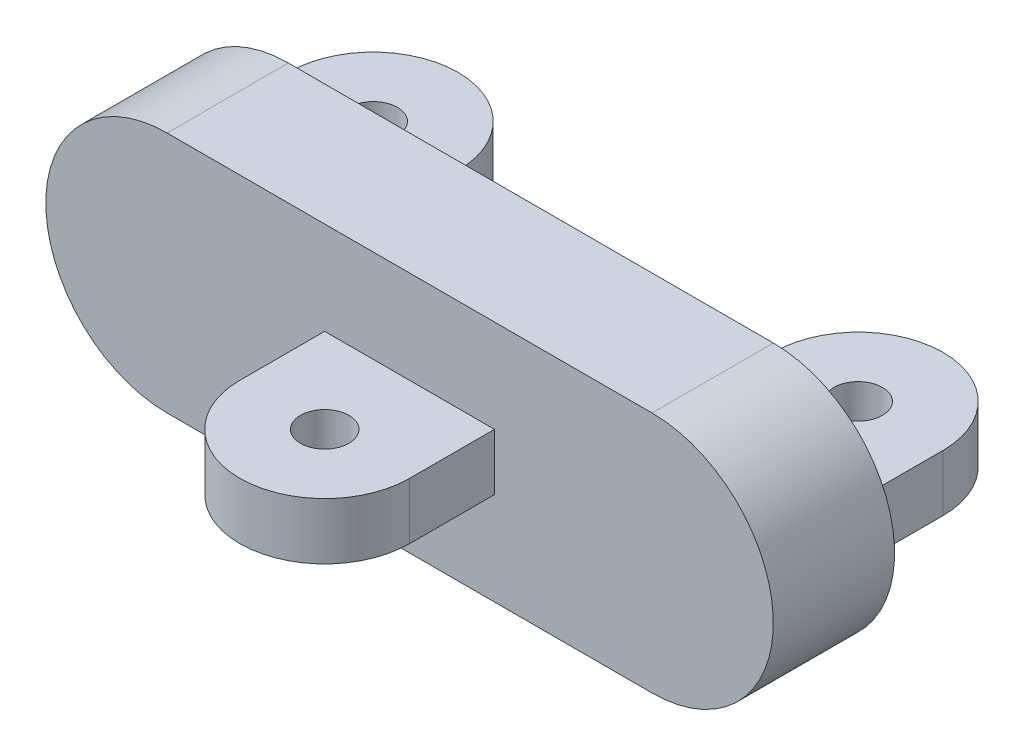
ISO-10303-21;
HEADER;
FILE_DESCRIPTION(('STEP AP214'),'2;1');
FILE_NAME('part.step','',(''),(''),'','','');
FILE_SCHEMA(('AUTOMOTIVE_DESIGN { 1 0 10303 214 1 1 1 1 }'));
ENDSEC;
DATA;
#1=APPLICATION_CONTEXT('core data for automotive mechanical design processes');
#2=APPLICATION_PROTOCOL_DEFINITION('international standard','automotive_design',2000,#1);
#3=PRODUCT_CONTEXT('',#1,'mechanical');
#4=PRODUCT('Part','Part','',(#3));
#5=PRODUCT_RELATED_PRODUCT_CATEGORY('part','',(#4));
#6=PRODUCT_DEFINITION_FORMATION('','',#4);
#7=PRODUCT_DEFINITION_CONTEXT('part definition',#1,'design');
#8=PRODUCT_DEFINITION('design','',#6,#7);
#9=PRODUCT_DEFINITION_SHAPE('','',#8);
#10=(LENGTH_UNIT() NAMED_UNIT(*) SI_UNIT(.MILLI.,.METRE.));
#11=(NAMED_UNIT(*) PLANE_ANGLE_UNIT() SI_UNIT($,.RADIAN.));
#12=(NAMED_UNIT(*) SI_UNIT($,.STERADIAN.) SOLID_ANGLE_UNIT());
#13=UNCERTAINTY_MEASURE_WITH_UNIT(LENGTH_MEASURE(1.E-05),#10,'distance_accuracy_value','');
#14=(GEOMETRIC_REPRESENTATION_CONTEXT(3) GLOBAL_UNCERTAINTY_ASSIGNED_CONTEXT((#13)) GLOBAL_UNIT_ASSIGNED_CONTEXT((#10,
#11,#12)) REPRESENTATION_CONTEXT('',''));
#15=CARTESIAN_POINT('',(0.,0.,0.));
#16=DIRECTION('',(0.,0.,1.));
#17=DIRECTION('',(1.,0.,0.));
#18=AXIS2_PLACEMENT_3D('',#15,#16,#17);
#19=CARTESIAN_POINT('',(10.,0.,-5.));
#20=DIRECTION('',(0.,0.,1.));
#21=DIRECTION('',(1.,0.,0.));
#22=AXIS2_PLACEMENT_3D('',#19,#20,#21);
#23=PLANE('',#22);
#24=DIRECTION('',(0.,1.,0.));
#25=VECTOR('',#24,1.);
#26=CARTESIAN_POINT('',(6.5,1.165,-5.));
#27=LINE('',#26,#25);
#28=CARTESIAN_POINT('',(6.5,-1.165,-5.));
#29=VERTEX_POINT('',#28);
#30=CARTESIAN_POINT('',(6.5,1.165,-5.));
#31=VERTEX_POINT('',#30);
#32=EDGE_CURVE('E225',#29,#31,#27,.T.);
#33=ORIENTED_EDGE('',*,*,#32,.F.);
#34=DIRECTION('',(-1.,0.,0.));
#35=VECTOR('',#34,1.);
#36=CARTESIAN_POINT('',(13.5,-1.165,-5.));
#37=LINE('',#36,#35);
#38=CARTESIAN_POINT('',(13.5,-1.165,-5.));
#39=VERTEX_POINT('',#38);
#40=EDGE_CURVE('E233',#39,#29,#37,.T.);
#41=ORIENTED_EDGE('',*,*,#40,.F.);
#42=DIRECTION('',(0.,-1.,0.));
#43=VECTOR('',#42,1.);
#44=CARTESIAN_POINT('',(13.5,1.165,-5.));
#45=LINE('',#44,#43);
#46=CARTESIAN_POINT('',(13.5,1.165,-5.));
#47=VERTEX_POINT('',#46);
#48=EDGE_CURVE('E245',#47,#39,#45,.T.);
#49=ORIENTED_EDGE('',*,*,#48,.F.);
#50=DIRECTION('',(1.,0.,0.));
#51=VECTOR('',#50,1.);
#52=CARTESIAN_POINT('',(13.5,1.165,-5.));
#53=LINE('',#52,#51);
#54=EDGE_CURVE('E241',#31,#47,#53,.T.);
#55=ORIENTED_EDGE('',*,*,#54,.F.);
#56=EDGE_LOOP('',(#33,#41,#49,#55));
#57=FACE_BOUND('',#56,.T.);
#58=CARTESIAN_POINT('',(10.,0.,-5.));
#59=DIRECTION('',(0.,0.,1.));
#60=DIRECTION('',(1.,0.,0.));
#61=AXIS2_PLACEMENT_3D('',#58,#59,#60);
#62=CIRCLE('',#61,5.);
#63=CARTESIAN_POINT('',(10.,-5.,-5.));
#64=VERTEX_POINT('',#63);
#65=CARTESIAN_POINT('',(9.99999999999999,5.,-5.));
#66=VERTEX_POINT('',#65);
#67=EDGE_CURVE('E320',#64,#66,#62,.T.);
#68=ORIENTED_EDGE('',*,*,#67,.F.);
#69=DIRECTION('',(1.,0.,0.));
#70=VECTOR('',#69,1.);
#71=CARTESIAN_POINT('',(-10.,-5.,-5.));
#72=LINE('',#71,#70);
#73=CARTESIAN_POINT('',(-10.,-5.,-5.));
#74=VERTEX_POINT('',#73);
#75=EDGE_CURVE('E333',#74,#64,#72,.T.);
#76=ORIENTED_EDGE('',*,*,#75,.F.);
#77=CARTESIAN_POINT('',(-10.,0.,-5.));
#78=DIRECTION('',(0.,0.,1.));
#79=DIRECTION('',(-1.,0.,0.));
#80=AXIS2_PLACEMENT_3D('',#77,#78,#79);
#81=CIRCLE('',#80,5.);
#82=CARTESIAN_POINT('',(-10.,5.,-5.));
#83=VERTEX_POINT('',#82);
#84=EDGE_CURVE('E329',#83,#74,#81,.T.);
#85=ORIENTED_EDGE('',*,*,#84,.F.);
#86=DIRECTION('',(-1.,0.,0.));
#87=VECTOR('',#86,1.);
#88=CARTESIAN_POINT('',(-10.,5.,-5.));
#89=LINE('',#88,#87);
#90=EDGE_CURVE('E324',#66,#83,#89,.T.);
#91=ORIENTED_EDGE('',*,*,#90,.F.);
#92=EDGE_LOOP('',(#68,#76,#85,#91));
#93=FACE_BOUND('',#92,.T.);
#94=DIRECTION('',(0.,1.,0.));
#95=VECTOR('',#94,1.);
#96=CARTESIAN_POINT('',(-13.5,1.165,-5.));
#97=LINE('',#96,#95);
#98=CARTESIAN_POINT('',(-13.5,-1.165,-5.));
#99=VERTEX_POINT('',#98);
#100=CARTESIAN_POINT('',(-13.5,1.165,-5.));
#101=VERTEX_POINT('',#100);
#102=EDGE_CURVE('E222',#99,#101,#97,.T.);
#103=ORIENTED_EDGE('',*,*,#102,.F.);
#104=DIRECTION('',(-1.,0.,0.));
#105=VECTOR('',#104,1.);
#106=CARTESIAN_POINT('',(-13.5,-1.165,-5.));
#107=LINE('',#106,#105);
#108=CARTESIAN_POINT('',(-6.5,-1.165,-5.));
#109=VERTEX_POINT('',#108);
#110=EDGE_CURVE('E171',#109,#99,#107,.T.);
#111=ORIENTED_EDGE('',*,*,#110,.F.);
#112=DIRECTION('',(0.,-1.,0.));
#113=VECTOR('',#112,1.);
#114=CARTESIAN_POINT('',(-6.5,1.165,-5.));
#115=LINE('',#114,#113);
#116=CARTESIAN_POINT('',(-6.5,1.165,-5.));
#117=VERTEX_POINT('',#116);
#118=EDGE_CURVE('E70',#117,#109,#115,.T.);
#119=ORIENTED_EDGE('',*,*,#118,.F.);
#120=DIRECTION('',(1.,0.,0.));
#121=VECTOR('',#120,1.);
#122=CARTESIAN_POINT('',(-13.5,1.165,-5.));
#123=LINE('',#122,#121);
#124=EDGE_CURVE('E65',#101,#117,#123,.T.);
#125=ORIENTED_EDGE('',*,*,#124,.F.);
#126=EDGE_LOOP('',(#103,#111,#119,#125));
#127=FACE_BOUND('',#126,.T.);
#128=ADVANCED_FACE('F47',(#57,#93,#127),#23,.F.);
#129=CARTESIAN_POINT('',(10.,0.,0.));
#130=DIRECTION('',(0.,0.,1.));
#131=DIRECTION('',(1.,0.,0.));
#132=AXIS2_PLACEMENT_3D('',#129,#130,#131);
#133=PLANE('',#132);
#134=CARTESIAN_POINT('',(10.,0.,0.));
#135=DIRECTION('',(0.,0.,1.));
#136=DIRECTION('',(1.,0.,0.));
#137=AXIS2_PLACEMENT_3D('',#134,#135,#136);
#138=CIRCLE('',#137,5.);
#139=CARTESIAN_POINT('',(10.,-5.,0.));
#140=VERTEX_POINT('',#139);
#141=CARTESIAN_POINT('',(9.99999999999999,5.,0.));
#142=VERTEX_POINT('',#141);
#143=EDGE_CURVE('E319',#140,#142,#138,.T.);
#144=ORIENTED_EDGE('',*,*,#143,.T.);
#145=DIRECTION('',(-1.,0.,0.));
#146=VECTOR('',#145,1.);
#147=CARTESIAN_POINT('',(-10.,5.,0.));
#148=LINE('',#147,#146);
#149=CARTESIAN_POINT('',(-10.,5.,0.));
#150=VERTEX_POINT('',#149);
#151=EDGE_CURVE('E340',#142,#150,#148,.T.);
#152=ORIENTED_EDGE('',*,*,#151,.T.);
#153=CARTESIAN_POINT('',(-10.,0.,0.));
#154=DIRECTION('',(0.,0.,1.));
#155=DIRECTION('',(-1.,0.,0.));
#156=AXIS2_PLACEMENT_3D('',#153,#154,#155);
#157=CIRCLE('',#156,5.);
#158=CARTESIAN_POINT('',(-10.,-5.,0.));
#159=VERTEX_POINT('',#158);
#160=EDGE_CURVE('E344',#150,#159,#157,.T.);
#161=ORIENTED_EDGE('',*,*,#160,.T.);
#162=DIRECTION('',(1.,0.,0.));
#163=VECTOR('',#162,1.);
#164=CARTESIAN_POINT('',(-10.,-5.,0.));
#165=LINE('',#164,#163);
#166=EDGE_CURVE('E325',#159,#140,#165,.T.);
#167=ORIENTED_EDGE('',*,*,#166,.T.);
#168=EDGE_LOOP('',(#144,#152,#161,#167));
#169=FACE_BOUND('',#168,.T.);
#170=DIRECTION('',(-1.,0.,0.));
#171=VECTOR('',#170,1.);
#172=CARTESIAN_POINT('',(-3.5,1.16666666666667,0.));
#173=LINE('',#172,#171);
#174=CARTESIAN_POINT('',(3.5,1.16666666666667,0.));
#175=VERTEX_POINT('',#174);
#176=CARTESIAN_POINT('',(-3.5,1.16666666666667,0.));
#177=VERTEX_POINT('',#176);
#178=EDGE_CURVE('E297',#175,#177,#173,.T.);
#179=ORIENTED_EDGE('',*,*,#178,.F.);
#180=DIRECTION('',(0.,1.,0.));
#181=VECTOR('',#180,1.);
#182=CARTESIAN_POINT('',(3.5,-1.16666666666667,0.));
#183=LINE('',#182,#181);
#184=CARTESIAN_POINT('',(3.5,-1.16666666666667,0.));
#185=VERTEX_POINT('',#184);
#186=EDGE_CURVE('E283',#185,#175,#183,.T.);
#187=ORIENTED_EDGE('',*,*,#186,.F.);
#188=DIRECTION('',(1.,0.,0.));
#189=VECTOR('',#188,1.);
#190=CARTESIAN_POINT('',(-3.5,-1.16666666666667,0.));
#191=LINE('',#190,#189);
#192=CARTESIAN_POINT('',(-3.5,-1.16666666666667,0.));
#193=VERTEX_POINT('',#192);
#194=EDGE_CURVE('E289',#193,#185,#191,.T.);
#195=ORIENTED_EDGE('',*,*,#194,.F.);
#196=DIRECTION('',(0.,-1.,0.));
#197=VECTOR('',#196,1.);
#198=CARTESIAN_POINT('',(-3.5,-1.16666666666667,0.));
#199=LINE('',#198,#197);
#200=EDGE_CURVE('E300',#177,#193,#199,.T.);
#201=ORIENTED_EDGE('',*,*,#200,.F.);
#202=EDGE_LOOP('',(#179,#187,#195,#201));
#203=FACE_BOUND('',#202,.T.);
#204=ADVANCED_FACE('F364',(#169,#203),#133,.T.);
#205=CARTESIAN_POINT('',(10.,0.,-5.));
#206=DIRECTION('',(0.,0.,1.));
#207=DIRECTION('',(1.,0.,0.));
#208=AXIS2_PLACEMENT_3D('',#205,#206,#207);
#209=CYLINDRICAL_SURFACE('',#208,5.);
#210=ORIENTED_EDGE('',*,*,#143,.F.);
#211=DIRECTION('',(0.,0.,1.));
#212=VECTOR('',#211,1.);
#213=CARTESIAN_POINT('',(10.,-5.,-5.));
#214=LINE('',#213,#212);
#215=EDGE_CURVE('E11',#64,#140,#214,.T.);
#216=ORIENTED_EDGE('',*,*,#215,.F.);
#217=ORIENTED_EDGE('',*,*,#67,.T.);
#218=DIRECTION('',(0.,0.,1.));
#219=VECTOR('',#218,1.);
#220=CARTESIAN_POINT('',(9.99999999999999,5.,-5.));
#221=LINE('',#220,#219);
#222=EDGE_CURVE('E51',#66,#142,#221,.T.);
#223=ORIENTED_EDGE('',*,*,#222,.T.);
#224=EDGE_LOOP('',(#210,#216,#217,#223));
#225=FACE_BOUND('',#224,.T.);
#226=ADVANCED_FACE('F49',(#225),#209,.T.);
#227=CARTESIAN_POINT('',(-10.,-5.,-5.));
#228=DIRECTION('',(0.,-1.,0.));
#229=DIRECTION('',(0.,0.,-1.));
#230=AXIS2_PLACEMENT_3D('',#227,#228,#229);
#231=PLANE('',#230);
#232=ORIENTED_EDGE('',*,*,#166,.F.);
#233=DIRECTION('',(0.,0.,1.));
#234=VECTOR('',#233,1.);
#235=CARTESIAN_POINT('',(-10.,-5.,-5.));
#236=LINE('',#235,#234);
#237=EDGE_CURVE('E57',#74,#159,#236,.T.);
#238=ORIENTED_EDGE('',*,*,#237,.F.);
#239=ORIENTED_EDGE('',*,*,#75,.T.);
#240=ORIENTED_EDGE('',*,*,#215,.T.);
#241=EDGE_LOOP('',(#232,#238,#239,#240));
#242=FACE_BOUND('',#241,.T.);
#243=ADVANCED_FACE('F368',(#242),#231,.T.);
#244=CARTESIAN_POINT('',(-10.,0.,-5.));
#245=DIRECTION('',(0.,0.,1.));
#246=DIRECTION('',(1.,0.,0.));
#247=AXIS2_PLACEMENT_3D('',#244,#245,#246);
#248=CYLINDRICAL_SURFACE('',#247,5.);
#249=ORIENTED_EDGE('',*,*,#160,.F.);
#250=DIRECTION('',(0.,0.,1.));
#251=VECTOR('',#250,1.);
#252=CARTESIAN_POINT('',(-10.,5.,-5.));
#253=LINE('',#252,#251);
#254=EDGE_CURVE('E352',#83,#150,#253,.T.);
#255=ORIENTED_EDGE('',*,*,#254,.F.);
#256=ORIENTED_EDGE('',*,*,#84,.T.);
#257=ORIENTED_EDGE('',*,*,#237,.T.);
#258=EDGE_LOOP('',(#249,#255,#256,#257));
#259=FACE_BOUND('',#258,.T.);
#260=ADVANCED_FACE('F373',(#259),#248,.T.);
#261=CARTESIAN_POINT('',(-10.,5.,-5.));
#262=DIRECTION('',(0.,1.,0.));
#263=DIRECTION('',(0.,0.,1.));
#264=AXIS2_PLACEMENT_3D('',#261,#262,#263);
#265=PLANE('',#264);
#266=ORIENTED_EDGE('',*,*,#151,.F.);
#267=ORIENTED_EDGE('',*,*,#222,.F.);
#268=ORIENTED_EDGE('',*,*,#90,.T.);
#269=ORIENTED_EDGE('',*,*,#254,.T.);
#270=EDGE_LOOP('',(#266,#267,#268,#269));
#271=FACE_BOUND('',#270,.T.);
#272=ADVANCED_FACE('F362',(#271),#265,.T.);
#273=CARTESIAN_POINT('',(3.5,-1.16666666666667,3.5));
#274=DIRECTION('',(-1.,0.,0.));
#275=DIRECTION('',(0.,0.,1.));
#276=AXIS2_PLACEMENT_3D('',#273,#274,#275);
#277=PLANE('',#276);
#278=ORIENTED_EDGE('',*,*,#186,.T.);
#279=DIRECTION('',(0.,0.,-1.));
#280=VECTOR('',#279,1.);
#281=CARTESIAN_POINT('',(3.5,1.16666666666667,3.5));
#282=LINE('',#281,#280);
#283=CARTESIAN_POINT('',(3.5,1.16666666666667,3.5));
#284=VERTEX_POINT('',#283);
#285=EDGE_CURVE('E316',#284,#175,#282,.T.);
#286=ORIENTED_EDGE('',*,*,#285,.F.);
#287=DIRECTION('',(0.,1.,0.));
#288=VECTOR('',#287,1.);
#289=CARTESIAN_POINT('',(3.5,-1.16666666666667,3.5));
#290=LINE('',#289,#288);
#291=CARTESIAN_POINT('',(3.5,-1.16666666666667,3.5));
#292=VERTEX_POINT('',#291);
#293=EDGE_CURVE('E284',#292,#284,#290,.T.);
#294=ORIENTED_EDGE('',*,*,#293,.F.);
#295=DIRECTION('',(0.,0.,-1.));
#296=VECTOR('',#295,1.);
#297=CARTESIAN_POINT('',(3.5,-1.16666666666667,3.5));
#298=LINE('',#297,#296);
#299=EDGE_CURVE('E293',#292,#185,#298,.T.);
#300=ORIENTED_EDGE('',*,*,#299,.T.);
#301=EDGE_LOOP('',(#278,#286,#294,#300));
#302=FACE_BOUND('',#301,.T.);
#303=ADVANCED_FACE('F380',(#302),#277,.F.);
#304=CARTESIAN_POINT('',(-3.5,1.16666666666667,3.5));
#305=DIRECTION('',(0.,-1.,0.));
#306=DIRECTION('',(0.,0.,-1.));
#307=AXIS2_PLACEMENT_3D('',#304,#305,#306);
#308=PLANE('',#307);
#309=CARTESIAN_POINT('',(0.,1.16666666666667,3.5));
#310=DIRECTION('',(0.,1.,0.));
#311=DIRECTION('',(0.,0.,1.));
#312=AXIS2_PLACEMENT_3D('',#309,#310,#311);
#313=CIRCLE('',#312,1.);
#314=CARTESIAN_POINT('',(0.,1.16666666666667,4.5));
#315=VERTEX_POINT('',#314);
#316=EDGE_CURVE('E267',#315,#315,#313,.T.);
#317=ORIENTED_EDGE('',*,*,#316,.F.);
#318=EDGE_LOOP('',(#317));
#319=FACE_BOUND('',#318,.T.);
#320=ORIENTED_EDGE('',*,*,#178,.T.);
#321=DIRECTION('',(0.,0.,-1.));
#322=VECTOR('',#321,1.);
#323=CARTESIAN_POINT('',(-3.5,1.16666666666667,3.5));
#324=LINE('',#323,#322);
#325=CARTESIAN_POINT('',(-3.5,1.16666666666667,3.5));
#326=VERTEX_POINT('',#325);
#327=EDGE_CURVE('E312',#326,#177,#324,.T.);
#328=ORIENTED_EDGE('',*,*,#327,.F.);
#329=CARTESIAN_POINT('',(0.,1.16666666666667,3.5));
#330=DIRECTION('',(0.,-1.,0.));
#331=DIRECTION('',(1.,0.,0.));
#332=AXIS2_PLACEMENT_3D('',#329,#330,#331);
#333=CIRCLE('',#332,3.5);
#334=EDGE_CURVE('E275',#284,#326,#333,.T.);
#335=ORIENTED_EDGE('',*,*,#334,.F.);
#336=ORIENTED_EDGE('',*,*,#285,.T.);
#337=EDGE_LOOP('',(#320,#328,#335,#336));
#338=FACE_BOUND('',#337,.T.);
#339=ADVANCED_FACE('F394',(#319,#338),#308,.F.);
#340=CARTESIAN_POINT('',(-3.5,-1.16666666666667,3.5));
#341=DIRECTION('',(1.,0.,0.));
#342=DIRECTION('',(0.,0.,-1.));
#343=AXIS2_PLACEMENT_3D('',#340,#341,#342);
#344=PLANE('',#343);
#345=ORIENTED_EDGE('',*,*,#200,.T.);
#346=DIRECTION('',(0.,0.,-1.));
#347=VECTOR('',#346,1.);
#348=CARTESIAN_POINT('',(-3.5,-1.16666666666667,3.5));
#349=LINE('',#348,#347);
#350=CARTESIAN_POINT('',(-3.5,-1.16666666666667,3.5));
#351=VERTEX_POINT('',#350);
#352=EDGE_CURVE('E309',#351,#193,#349,.T.);
#353=ORIENTED_EDGE('',*,*,#352,.F.);
#354=DIRECTION('',(0.,-1.,0.));
#355=VECTOR('',#354,1.);
#356=CARTESIAN_POINT('',(-3.5,-1.16666666666667,3.5));
#357=LINE('',#356,#355);
#358=EDGE_CURVE('E288',#326,#351,#357,.T.);
#359=ORIENTED_EDGE('',*,*,#358,.F.);
#360=ORIENTED_EDGE('',*,*,#327,.T.);
#361=EDGE_LOOP('',(#345,#353,#359,#360));
#362=FACE_BOUND('',#361,.T.);
#363=ADVANCED_FACE('F398',(#362),#344,.F.);
#364=CARTESIAN_POINT('',(-3.5,-1.16666666666667,3.5));
#365=DIRECTION('',(0.,1.,0.));
#366=DIRECTION('',(0.,0.,1.));
#367=AXIS2_PLACEMENT_3D('',#364,#365,#366);
#368=PLANE('',#367);
#369=CARTESIAN_POINT('',(0.,-1.16666666666667,3.5));
#370=DIRECTION('',(0.,1.,0.));
#371=DIRECTION('',(0.,0.,1.));
#372=AXIS2_PLACEMENT_3D('',#369,#370,#371);
#373=CIRCLE('',#372,1.);
#374=CARTESIAN_POINT('',(0.,-1.16666666666667,4.5));
#375=VERTEX_POINT('',#374);
#376=EDGE_CURVE('E271',#375,#375,#373,.F.);
#377=ORIENTED_EDGE('',*,*,#376,.F.);
#378=EDGE_LOOP('',(#377));
#379=FACE_BOUND('',#378,.T.);
#380=ORIENTED_EDGE('',*,*,#194,.T.);
#381=ORIENTED_EDGE('',*,*,#299,.F.);
#382=CARTESIAN_POINT('',(0.,-1.16666666666667,3.5));
#383=DIRECTION('',(0.,-1.,0.));
#384=DIRECTION('',(1.,0.,0.));
#385=AXIS2_PLACEMENT_3D('',#382,#383,#384);
#386=CIRCLE('',#385,3.5);
#387=EDGE_CURVE('E279',#292,#351,#386,.T.);
#388=ORIENTED_EDGE('',*,*,#387,.T.);
#389=ORIENTED_EDGE('',*,*,#352,.T.);
#390=EDGE_LOOP('',(#380,#381,#388,#389));
#391=FACE_BOUND('',#390,.T.);
#392=ADVANCED_FACE('F402',(#379,#391),#368,.F.);
#393=CARTESIAN_POINT('',(0.,1.16666666666667,3.5));
#394=DIRECTION('',(0.,-1.,0.));
#395=DIRECTION('',(1.,0.,0.));
#396=AXIS2_PLACEMENT_3D('',#393,#394,#395);
#397=CYLINDRICAL_SURFACE('',#396,3.5);
#398=ORIENTED_EDGE('',*,*,#293,.T.);
#399=ORIENTED_EDGE('',*,*,#334,.T.);
#400=ORIENTED_EDGE('',*,*,#358,.T.);
#401=ORIENTED_EDGE('',*,*,#387,.F.);
#402=EDGE_LOOP('',(#398,#399,#400,#401));
#403=FACE_BOUND('',#402,.T.);
#404=ADVANCED_FACE('F406',(#403),#397,.T.);
#405=CARTESIAN_POINT('',(0.,-5.001,3.5));
#406=DIRECTION('',(0.,1.,0.));
#407=DIRECTION('',(0.,0.,1.));
#408=AXIS2_PLACEMENT_3D('',#405,#406,#407);
#409=CYLINDRICAL_SURFACE('',#408,1.);
#410=ORIENTED_EDGE('',*,*,#316,.T.);
#411=EDGE_LOOP('',(#410));
#412=FACE_BOUND('',#411,.T.);
#413=ORIENTED_EDGE('',*,*,#376,.T.);
#414=EDGE_LOOP('',(#413));
#415=FACE_BOUND('',#414,.T.);
#416=ADVANCED_FACE('F410',(#412,#415),#409,.F.);
#417=CARTESIAN_POINT('',(6.5,1.165,-8.5));
#418=DIRECTION('',(1.,0.,0.));
#419=DIRECTION('',(0.,1.,0.));
#420=AXIS2_PLACEMENT_3D('',#417,#418,#419);
#421=PLANE('',#420);
#422=ORIENTED_EDGE('',*,*,#32,.T.);
#423=DIRECTION('',(0.,0.,1.));
#424=VECTOR('',#423,1.);
#425=CARTESIAN_POINT('',(6.5,1.165,-8.5));
#426=LINE('',#425,#424);
#427=CARTESIAN_POINT('',(6.5,1.165,-8.5));
#428=VERTEX_POINT('',#427);
#429=EDGE_CURVE('E263',#428,#31,#426,.T.);
#430=ORIENTED_EDGE('',*,*,#429,.F.);
#431=DIRECTION('',(0.,1.,0.));
#432=VECTOR('',#431,1.);
#433=CARTESIAN_POINT('',(6.5,1.165,-8.5));
#434=LINE('',#433,#432);
#435=CARTESIAN_POINT('',(6.49999999999999,-1.165,-8.49999999999998));
#436=VERTEX_POINT('',#435);
#437=EDGE_CURVE('E228',#436,#428,#434,.T.);
#438=ORIENTED_EDGE('',*,*,#437,.F.);
#439=DIRECTION('',(0.,0.,1.));
#440=VECTOR('',#439,1.);
#441=CARTESIAN_POINT('',(6.5,-1.165,-8.5));
#442=LINE('',#441,#440);
#443=EDGE_CURVE('E237',#436,#29,#442,.T.);
#444=ORIENTED_EDGE('',*,*,#443,.T.);
#445=EDGE_LOOP('',(#422,#430,#438,#444));
#446=FACE_BOUND('',#445,.T.);
#447=ADVANCED_FACE('F413',(#446),#421,.F.);
#448=CARTESIAN_POINT('',(13.5,1.165,-8.5));
#449=DIRECTION('',(0.,-1.,0.));
#450=DIRECTION('',(0.,0.,-1.));
#451=AXIS2_PLACEMENT_3D('',#448,#449,#450);
#452=PLANE('',#451);
#453=CARTESIAN_POINT('',(9.99999999999999,1.165,-8.5));
#454=DIRECTION('',(0.,1.,0.));
#455=DIRECTION('',(0.,0.,-1.));
#456=AXIS2_PLACEMENT_3D('',#453,#454,#455);
#457=CIRCLE('',#456,1.);
#458=CARTESIAN_POINT('',(9.99999999999999,1.165,-9.5));
#459=VERTEX_POINT('',#458);
#460=EDGE_CURVE('E198',#459,#459,#457,.T.);
#461=ORIENTED_EDGE('',*,*,#460,.F.);
#462=EDGE_LOOP('',(#461));
#463=FACE_BOUND('',#462,.T.);
#464=ORIENTED_EDGE('',*,*,#54,.T.);
#465=DIRECTION('',(0.,0.,1.));
#466=VECTOR('',#465,1.);
#467=CARTESIAN_POINT('',(13.5,1.165,-8.5));
#468=LINE('',#467,#466);
#469=CARTESIAN_POINT('',(13.5,1.165,-8.5));
#470=VERTEX_POINT('',#469);
#471=EDGE_CURVE('E259',#470,#47,#468,.T.);
#472=ORIENTED_EDGE('',*,*,#471,.F.);
#473=CARTESIAN_POINT('',(9.99999999999999,1.165,-8.5));
#474=DIRECTION('',(0.,-1.,0.));
#475=DIRECTION('',(0.,0.,-1.));
#476=AXIS2_PLACEMENT_3D('',#473,#474,#475);
#477=CIRCLE('',#476,3.5);
#478=EDGE_CURVE('E204',#428,#470,#477,.T.);
#479=ORIENTED_EDGE('',*,*,#478,.F.);
#480=ORIENTED_EDGE('',*,*,#429,.T.);
#481=EDGE_LOOP('',(#464,#472,#479,#480));
#482=FACE_BOUND('',#481,.T.);
#483=ADVANCED_FACE('F416',(#463,#482),#452,.F.);
#484=CARTESIAN_POINT('',(13.5,1.165,-8.5));
#485=DIRECTION('',(-1.,0.,0.));
#486=DIRECTION('',(0.,0.,1.));
#487=AXIS2_PLACEMENT_3D('',#484,#485,#486);
#488=PLANE('',#487);
#489=ORIENTED_EDGE('',*,*,#48,.T.);
#490=DIRECTION('',(0.,0.,1.));
#491=VECTOR('',#490,1.);
#492=CARTESIAN_POINT('',(13.5,-1.165,-8.5));
#493=LINE('',#492,#491);
#494=CARTESIAN_POINT('',(13.5,-1.165,-8.5));
#495=VERTEX_POINT('',#494);
#496=EDGE_CURVE('E255',#495,#39,#493,.T.);
#497=ORIENTED_EDGE('',*,*,#496,.F.);
#498=DIRECTION('',(0.,-1.,0.));
#499=VECTOR('',#498,1.);
#500=CARTESIAN_POINT('',(13.5,1.165,-8.5));
#501=LINE('',#500,#499);
#502=EDGE_CURVE('E232',#470,#495,#501,.T.);
#503=ORIENTED_EDGE('',*,*,#502,.F.);
#504=ORIENTED_EDGE('',*,*,#471,.T.);
#505=EDGE_LOOP('',(#489,#497,#503,#504));
#506=FACE_BOUND('',#505,.T.);
#507=ADVANCED_FACE('F420',(#506),#488,.F.);
#508=CARTESIAN_POINT('',(13.5,-1.165,-8.5));
#509=DIRECTION('',(0.,1.,0.));
#510=DIRECTION('',(0.,0.,1.));
#511=AXIS2_PLACEMENT_3D('',#508,#509,#510);
#512=PLANE('',#511);
#513=CARTESIAN_POINT('',(9.99999999999999,-1.165,-8.5));
#514=DIRECTION('',(0.,1.,0.));
#515=DIRECTION('',(0.,0.,1.));
#516=AXIS2_PLACEMENT_3D('',#513,#514,#515);
#517=CIRCLE('',#516,1.);
#518=CARTESIAN_POINT('',(9.99999999999999,-1.165,-7.5));
#519=VERTEX_POINT('',#518);
#520=EDGE_CURVE('E465',#519,#519,#517,.F.);
#521=ORIENTED_EDGE('',*,*,#520,.F.);
#522=EDGE_LOOP('',(#521));
#523=FACE_BOUND('',#522,.T.);
#524=ORIENTED_EDGE('',*,*,#40,.T.);
#525=ORIENTED_EDGE('',*,*,#443,.F.);
#526=CARTESIAN_POINT('',(9.99999999999999,-1.165,-8.5));
#527=DIRECTION('',(0.,-1.,0.));
#528=DIRECTION('',(0.,0.,-1.));
#529=AXIS2_PLACEMENT_3D('',#526,#527,#528);
#530=CIRCLE('',#529,3.5);
#531=EDGE_CURVE('E192',#436,#495,#530,.T.);
#532=ORIENTED_EDGE('',*,*,#531,.T.);
#533=ORIENTED_EDGE('',*,*,#496,.T.);
#534=EDGE_LOOP('',(#524,#525,#532,#533));
#535=FACE_BOUND('',#534,.T.);
#536=ADVANCED_FACE('F424',(#523,#535),#512,.F.);
#537=CARTESIAN_POINT('',(-13.5,1.165,-8.5));
#538=DIRECTION('',(1.,0.,0.));
#539=DIRECTION('',(0.,0.,-1.));
#540=AXIS2_PLACEMENT_3D('',#537,#538,#539);
#541=PLANE('',#540);
#542=ORIENTED_EDGE('',*,*,#102,.T.);
#543=DIRECTION('',(0.,0.,1.));
#544=VECTOR('',#543,1.);
#545=CARTESIAN_POINT('',(-13.5,1.165,-8.5));
#546=LINE('',#545,#544);
#547=CARTESIAN_POINT('',(-13.5,1.165,-8.5));
#548=VERTEX_POINT('',#547);
#549=EDGE_CURVE('E165',#548,#101,#546,.T.);
#550=ORIENTED_EDGE('',*,*,#549,.F.);
#551=DIRECTION('',(0.,1.,0.));
#552=VECTOR('',#551,1.);
#553=CARTESIAN_POINT('',(-13.5,1.165,-8.5));
#554=LINE('',#553,#552);
#555=CARTESIAN_POINT('',(-13.5,-1.165,-8.49999999999998));
#556=VERTEX_POINT('',#555);
#557=EDGE_CURVE('E160',#556,#548,#554,.T.);
#558=ORIENTED_EDGE('',*,*,#557,.F.);
#559=DIRECTION('',(0.,0.,1.));
#560=VECTOR('',#559,1.);
#561=CARTESIAN_POINT('',(-13.5,-1.165,-8.5));
#562=LINE('',#561,#560);
#563=EDGE_CURVE('E164',#556,#99,#562,.T.);
#564=ORIENTED_EDGE('',*,*,#563,.T.);
#565=EDGE_LOOP('',(#542,#550,#558,#564));
#566=FACE_BOUND('',#565,.T.);
#567=ADVANCED_FACE('F163',(#566),#541,.F.);
#568=CARTESIAN_POINT('',(-13.5,1.165,-8.5));
#569=DIRECTION('',(0.,-1.,0.));
#570=DIRECTION('',(0.,0.,-1.));
#571=AXIS2_PLACEMENT_3D('',#568,#569,#570);
#572=PLANE('',#571);
#573=CARTESIAN_POINT('',(-9.99999999999999,1.165,-8.5));
#574=DIRECTION('',(0.,1.,0.));
#575=DIRECTION('',(0.,0.,1.));
#576=AXIS2_PLACEMENT_3D('',#573,#574,#575);
#577=CIRCLE('',#576,1.);
#578=CARTESIAN_POINT('',(-9.99999999999999,1.165,-7.5));
#579=VERTEX_POINT('',#578);
#580=EDGE_CURVE('E195',#579,#579,#577,.T.);
#581=ORIENTED_EDGE('',*,*,#580,.F.);
#582=EDGE_LOOP('',(#581));
#583=FACE_BOUND('',#582,.T.);
#584=ORIENTED_EDGE('',*,*,#124,.T.);
#585=DIRECTION('',(0.,0.,1.));
#586=VECTOR('',#585,1.);
#587=CARTESIAN_POINT('',(-6.5,1.165,-8.5));
#588=LINE('',#587,#586);
#589=CARTESIAN_POINT('',(-6.5,1.165,-8.5));
#590=VERTEX_POINT('',#589);
#591=EDGE_CURVE('E210',#590,#117,#588,.T.);
#592=ORIENTED_EDGE('',*,*,#591,.F.);
#593=CARTESIAN_POINT('',(-9.99999999999999,1.165,-8.5));
#594=DIRECTION('',(0.,-1.,0.));
#595=DIRECTION('',(0.,0.,-1.));
#596=AXIS2_PLACEMENT_3D('',#593,#594,#595);
#597=CIRCLE('',#596,3.5);
#598=EDGE_CURVE('E187',#548,#590,#597,.T.);
#599=ORIENTED_EDGE('',*,*,#598,.F.);
#600=ORIENTED_EDGE('',*,*,#549,.T.);
#601=EDGE_LOOP('',(#584,#592,#599,#600));
#602=FACE_BOUND('',#601,.T.);
#603=ADVANCED_FACE('F436',(#583,#602),#572,.F.);
#604=CARTESIAN_POINT('',(-6.5,1.165,-8.5));
#605=DIRECTION('',(-1.,0.,0.));
#606=DIRECTION('',(0.,-1.,0.));
#607=AXIS2_PLACEMENT_3D('',#604,#605,#606);
#608=PLANE('',#607);
#609=ORIENTED_EDGE('',*,*,#118,.T.);
#610=DIRECTION('',(0.,0.,1.));
#611=VECTOR('',#610,1.);
#612=CARTESIAN_POINT('',(-6.5,-1.165,-8.5));
#613=LINE('',#612,#611);
#614=CARTESIAN_POINT('',(-6.5,-1.165,-8.5));
#615=VERTEX_POINT('',#614);
#616=EDGE_CURVE('E182',#615,#109,#613,.T.);
#617=ORIENTED_EDGE('',*,*,#616,.F.);
#618=DIRECTION('',(0.,-1.,0.));
#619=VECTOR('',#618,1.);
#620=CARTESIAN_POINT('',(-6.5,1.165,-8.5));
#621=LINE('',#620,#619);
#622=EDGE_CURVE('E172',#590,#615,#621,.T.);
#623=ORIENTED_EDGE('',*,*,#622,.F.);
#624=ORIENTED_EDGE('',*,*,#591,.T.);
#625=EDGE_LOOP('',(#609,#617,#623,#624));
#626=FACE_BOUND('',#625,.T.);
#627=ADVANCED_FACE('F432',(#626),#608,.F.);
#628=CARTESIAN_POINT('',(-13.5,-1.165,-8.5));
#629=DIRECTION('',(0.,1.,0.));
#630=DIRECTION('',(0.,0.,1.));
#631=AXIS2_PLACEMENT_3D('',#628,#629,#630);
#632=PLANE('',#631);
#633=CARTESIAN_POINT('',(-9.99999999999999,-1.165,-8.5));
#634=DIRECTION('',(0.,1.,0.));
#635=DIRECTION('',(0.,0.,1.));
#636=AXIS2_PLACEMENT_3D('',#633,#634,#635);
#637=CIRCLE('',#636,1.);
#638=CARTESIAN_POINT('',(-9.99999999999999,-1.165,-7.5));
#639=VERTEX_POINT('',#638);
#640=EDGE_CURVE('E188',#639,#639,#637,.F.);
#641=ORIENTED_EDGE('',*,*,#640,.F.);
#642=EDGE_LOOP('',(#641));
#643=FACE_BOUND('',#642,.T.);
#644=ORIENTED_EDGE('',*,*,#110,.T.);
#645=ORIENTED_EDGE('',*,*,#563,.F.);
#646=CARTESIAN_POINT('',(-9.99999999999999,-1.165,-8.5));
#647=DIRECTION('',(0.,-1.,0.));
#648=DIRECTION('',(0.,0.,-1.));
#649=AXIS2_PLACEMENT_3D('',#646,#647,#648);
#650=CIRCLE('',#649,3.5);
#651=EDGE_CURVE('E179',#556,#615,#650,.T.);
#652=ORIENTED_EDGE('',*,*,#651,.T.);
#653=ORIENTED_EDGE('',*,*,#616,.T.);
#654=EDGE_LOOP('',(#644,#645,#652,#653));
#655=FACE_BOUND('',#654,.T.);
#656=ADVANCED_FACE('F177',(#643,#655),#632,.F.);
#657=CARTESIAN_POINT('',(9.99999999999999,1.165,-8.5));
#658=DIRECTION('',(0.,-1.,0.));
#659=DIRECTION('',(0.,0.,-1.));
#660=AXIS2_PLACEMENT_3D('',#657,#658,#659);
#661=CYLINDRICAL_SURFACE('',#660,3.5);
#662=ORIENTED_EDGE('',*,*,#531,.F.);
#663=ORIENTED_EDGE('',*,*,#437,.T.);
#664=ORIENTED_EDGE('',*,*,#478,.T.);
#665=ORIENTED_EDGE('',*,*,#502,.T.);
#666=EDGE_LOOP('',(#662,#663,#664,#665));
#667=FACE_BOUND('',#666,.T.);
#668=ADVANCED_FACE('F431',(#667),#661,.T.);
#669=CARTESIAN_POINT('',(-9.99999999999999,1.165,-8.5));
#670=DIRECTION('',(0.,-1.,0.));
#671=DIRECTION('',(0.,0.,-1.));
#672=AXIS2_PLACEMENT_3D('',#669,#670,#671);
#673=CYLINDRICAL_SURFACE('',#672,3.5);
#674=ORIENTED_EDGE('',*,*,#651,.F.);
#675=ORIENTED_EDGE('',*,*,#557,.T.);
#676=ORIENTED_EDGE('',*,*,#598,.T.);
#677=ORIENTED_EDGE('',*,*,#622,.T.);
#678=EDGE_LOOP('',(#674,#675,#676,#677));
#679=FACE_BOUND('',#678,.T.);
#680=ADVANCED_FACE('F184',(#679),#673,.T.);
#681=CARTESIAN_POINT('',(-9.99999999999999,-5.001,-8.5));
#682=DIRECTION('',(0.,1.,0.));
#683=DIRECTION('',(0.,0.,1.));
#684=AXIS2_PLACEMENT_3D('',#681,#682,#683);
#685=CYLINDRICAL_SURFACE('',#684,1.);
#686=ORIENTED_EDGE('',*,*,#580,.T.);
#687=EDGE_LOOP('',(#686));
#688=FACE_BOUND('',#687,.T.);
#689=ORIENTED_EDGE('',*,*,#640,.T.);
#690=EDGE_LOOP('',(#689));
#691=FACE_BOUND('',#690,.T.);
#692=ADVANCED_FACE('F448',(#688,#691),#685,.F.);
#693=CARTESIAN_POINT('',(9.99999999999999,-5.001,-8.5));
#694=DIRECTION('',(0.,1.,0.));
#695=DIRECTION('',(0.,0.,1.));
#696=AXIS2_PLACEMENT_3D('',#693,#694,#695);
#697=CYLINDRICAL_SURFACE('',#696,1.);
#698=ORIENTED_EDGE('',*,*,#460,.T.);
#699=EDGE_LOOP('',(#698));
#700=FACE_BOUND('',#699,.T.);
#701=ORIENTED_EDGE('',*,*,#520,.T.);
#702=EDGE_LOOP('',(#701));
#703=FACE_BOUND('',#702,.T.);
#704=ADVANCED_FACE('F449',(#700,#703),#697,.F.);
#705=CLOSED_SHELL('',(#128,#204,#226,#243,#260,#272,#303,#339,#363,#392,#404,#416,#447,#483,
#507,#536,#567,#603,#627,#656,#668,#680,#692,#704));
#706=MANIFOLD_SOLID_BREP('B2',#705);
#707=ADVANCED_BREP_SHAPE_REPRESENTATION('',(#18,#706),#14);
#708=SHAPE_DEFINITION_REPRESENTATION(#9,#707);
ENDSEC;
END-ISO-10303-21;
